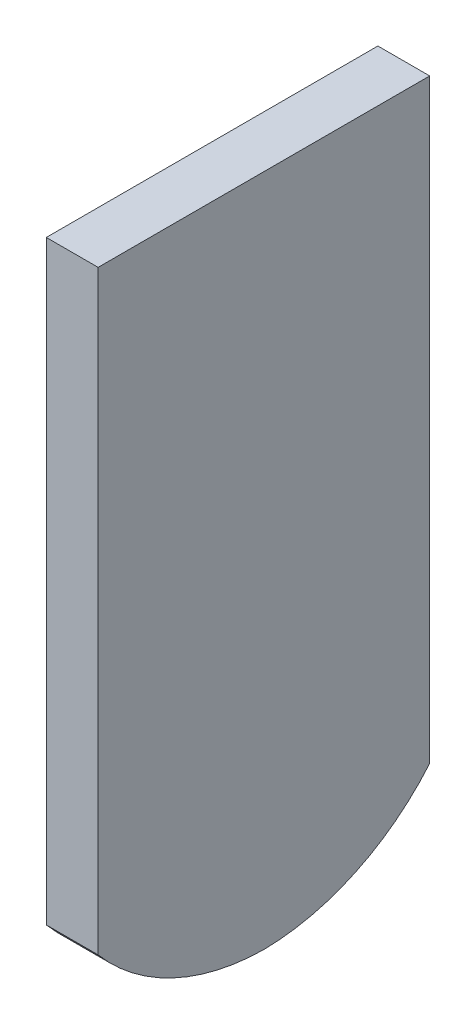
ISO-10303-21;
HEADER;
FILE_DESCRIPTION(('STEP AP214'),'2;1');
FILE_NAME('part.step','',(''),(''),'','','');
FILE_SCHEMA(('AUTOMOTIVE_DESIGN { 1 0 10303 214 1 1 1 1 }'));
ENDSEC;
DATA;
#1=APPLICATION_CONTEXT('core data for automotive mechanical design processes');
#2=APPLICATION_PROTOCOL_DEFINITION('international standard','automotive_design',2000,#1);
#3=PRODUCT_CONTEXT('',#1,'mechanical');
#4=PRODUCT('Part','Part','',(#3));
#5=PRODUCT_RELATED_PRODUCT_CATEGORY('part','',(#4));
#6=PRODUCT_DEFINITION_FORMATION('','',#4);
#7=PRODUCT_DEFINITION_CONTEXT('part definition',#1,'design');
#8=PRODUCT_DEFINITION('design','',#6,#7);
#9=PRODUCT_DEFINITION_SHAPE('','',#8);
#10=(LENGTH_UNIT() NAMED_UNIT(*) SI_UNIT(.MILLI.,.METRE.));
#11=(NAMED_UNIT(*) PLANE_ANGLE_UNIT() SI_UNIT($,.RADIAN.));
#12=(NAMED_UNIT(*) SI_UNIT($,.STERADIAN.) SOLID_ANGLE_UNIT());
#13=UNCERTAINTY_MEASURE_WITH_UNIT(LENGTH_MEASURE(1.E-05),#10,'distance_accuracy_value','');
#14=(GEOMETRIC_REPRESENTATION_CONTEXT(3) GLOBAL_UNCERTAINTY_ASSIGNED_CONTEXT((#13)) GLOBAL_UNIT_ASSIGNED_CONTEXT((#10,
#11,#12)) REPRESENTATION_CONTEXT('',''));
#15=CARTESIAN_POINT('',(0.,0.,0.));
#16=DIRECTION('',(0.,0.,1.));
#17=DIRECTION('',(1.,0.,0.));
#18=AXIS2_PLACEMENT_3D('',#15,#16,#17);
#19=CARTESIAN_POINT('',(47.975000062,56.813409305375,30.475));
#20=DIRECTION('',(-1.,0.,0.));
#21=DIRECTION('',(0.,0.,1.));
#22=AXIS2_PLACEMENT_3D('',#19,#20,#21);
#23=PLANE('',#22);
#24=DIRECTION('',(0.,-1.,0.));
#25=VECTOR('',#24,1.);
#26=CARTESIAN_POINT('',(47.975000062,149.7,-30.475));
#27=LINE('',#26,#25);
#28=CARTESIAN_POINT('',(47.975000062,140.175,-30.475));
#29=VERTEX_POINT('',#28);
#30=CARTESIAN_POINT('',(47.975000062,30.7285789436494,-30.475));
#31=VERTEX_POINT('',#30);
#32=EDGE_CURVE('E93',#29,#31,#27,.T.);
#33=ORIENTED_EDGE('',*,*,#32,.T.);
#34=CARTESIAN_POINT('',(47.975000062,56.813409305375,0.479999999999994));
#35=DIRECTION('',(-1.,0.,0.));
#36=DIRECTION('',(0.,0.,1.));
#37=AXIS2_PLACEMENT_3D('',#34,#35,#36);
#38=CIRCLE('',#37,40.48);
#39=CARTESIAN_POINT('',(47.975000062,16.3362552552198,-2.99402429931872E-13));
#40=VERTEX_POINT('',#39);
#41=EDGE_CURVE('E95',#40,#31,#38,.F.);
#42=ORIENTED_EDGE('',*,*,#41,.F.);
#43=CARTESIAN_POINT('',(47.975000062,56.813409305375,-0.480000000000008));
#44=DIRECTION('',(-1.,0.,0.));
#45=DIRECTION('',(0.,0.,1.));
#46=AXIS2_PLACEMENT_3D('',#43,#44,#45);
#47=CIRCLE('',#46,40.48);
#48=CARTESIAN_POINT('',(47.975000062,30.7285789436494,30.475));
#49=VERTEX_POINT('',#48);
#50=EDGE_CURVE('E49',#49,#40,#47,.F.);
#51=ORIENTED_EDGE('',*,*,#50,.F.);
#52=DIRECTION('',(0.,-1.,0.));
#53=VECTOR('',#52,1.);
#54=CARTESIAN_POINT('',(47.975000062,149.7,30.475));
#55=LINE('',#54,#53);
#56=CARTESIAN_POINT('',(47.975000062,140.175,30.475));
#57=VERTEX_POINT('',#56);
#58=EDGE_CURVE('E11',#57,#49,#55,.T.);
#59=ORIENTED_EDGE('',*,*,#58,.F.);
#60=DIRECTION('',(0.,0.,-1.));
#61=VECTOR('',#60,1.);
#62=CARTESIAN_POINT('',(47.975000062,140.175,0.));
#63=LINE('',#62,#61);
#64=EDGE_CURVE('E97',#57,#29,#63,.T.);
#65=ORIENTED_EDGE('',*,*,#64,.T.);
#66=EDGE_LOOP('',(#33,#42,#51,#59,#65));
#67=FACE_BOUND('',#66,.T.);
#68=ADVANCED_FACE('F45',(#67),#23,.T.);
#69=CARTESIAN_POINT('',(-47.975000062,140.175,30.475));
#70=DIRECTION('',(0.,0.,-1.));
#71=DIRECTION('',(-1.,0.,0.));
#72=AXIS2_PLACEMENT_3D('',#69,#70,#71);
#73=PLANE('',#72);
#74=ORIENTED_EDGE('',*,*,#58,.T.);
#75=DIRECTION('',(-1.,0.,0.));
#76=VECTOR('',#75,1.);
#77=CARTESIAN_POINT('',(-57.500000062,30.7285789436494,30.475));
#78=LINE('',#77,#76);
#79=CARTESIAN_POINT('',(57.500000062,30.7285789436494,30.475));
#80=VERTEX_POINT('',#79);
#81=EDGE_CURVE('E111',#49,#80,#78,.F.);
#82=ORIENTED_EDGE('',*,*,#81,.T.);
#83=DIRECTION('',(0.,1.,0.));
#84=VECTOR('',#83,1.);
#85=CARTESIAN_POINT('',(57.500000062,56.813409305375,30.475));
#86=LINE('',#85,#84);
#87=CARTESIAN_POINT('',(57.500000062,140.175,30.475));
#88=VERTEX_POINT('',#87);
#89=EDGE_CURVE('E54',#80,#88,#86,.T.);
#90=ORIENTED_EDGE('',*,*,#89,.T.);
#91=DIRECTION('',(1.,0.,0.));
#92=VECTOR('',#91,1.);
#93=CARTESIAN_POINT('',(47.975000062,140.175,30.475));
#94=LINE('',#93,#92);
#95=EDGE_CURVE('E67',#57,#88,#94,.T.);
#96=ORIENTED_EDGE('',*,*,#95,.F.);
#97=EDGE_LOOP('',(#74,#82,#90,#96));
#98=FACE_BOUND('',#97,.T.);
#99=ADVANCED_FACE('F124',(#98),#73,.F.);
#100=CARTESIAN_POINT('',(47.975000062,140.175,-30.475));
#101=DIRECTION('',(0.,0.,1.));
#102=DIRECTION('',(1.,0.,0.));
#103=AXIS2_PLACEMENT_3D('',#100,#101,#102);
#104=PLANE('',#103);
#105=DIRECTION('',(-1.,0.,0.));
#106=VECTOR('',#105,1.);
#107=CARTESIAN_POINT('',(-57.500000062,30.7285789436494,-30.475));
#108=LINE('',#107,#106);
#109=CARTESIAN_POINT('',(57.500000062,30.7285789436495,-30.475));
#110=VERTEX_POINT('',#109);
#111=EDGE_CURVE('E105',#110,#31,#108,.T.);
#112=ORIENTED_EDGE('',*,*,#111,.T.);
#113=ORIENTED_EDGE('',*,*,#32,.F.);
#114=DIRECTION('',(-1.,0.,0.));
#115=VECTOR('',#114,1.);
#116=CARTESIAN_POINT('',(47.975000062,140.175,-30.475));
#117=LINE('',#116,#115);
#118=CARTESIAN_POINT('',(57.500000062,140.175,-30.475));
#119=VERTEX_POINT('',#118);
#120=EDGE_CURVE('E112',#119,#29,#117,.T.);
#121=ORIENTED_EDGE('',*,*,#120,.F.);
#122=DIRECTION('',(0.,-1.,0.));
#123=VECTOR('',#122,1.);
#124=CARTESIAN_POINT('',(57.500000062,56.813409305375,-30.475));
#125=LINE('',#124,#123);
#126=EDGE_CURVE('E109',#119,#110,#125,.T.);
#127=ORIENTED_EDGE('',*,*,#126,.T.);
#128=EDGE_LOOP('',(#112,#113,#121,#127));
#129=FACE_BOUND('',#128,.T.);
#130=ADVANCED_FACE('F107',(#129),#104,.F.);
#131=CARTESIAN_POINT('',(-57.500000062,56.813409305375,0.479999999999994));
#132=DIRECTION('',(-1.,0.,0.));
#133=DIRECTION('',(0.,0.,1.));
#134=AXIS2_PLACEMENT_3D('',#131,#132,#133);
#135=CYLINDRICAL_SURFACE('',#134,40.48);
#136=DIRECTION('',(-1.,0.,0.));
#137=VECTOR('',#136,1.);
#138=CARTESIAN_POINT('',(0.,16.3362552552198,-2.99402429931872E-13));
#139=LINE('',#138,#137);
#140=CARTESIAN_POINT('',(57.500000062,16.3362552552198,-2.99510850149121E-13));
#141=VERTEX_POINT('',#140);
#142=EDGE_CURVE('E100',#40,#141,#139,.F.);
#143=ORIENTED_EDGE('',*,*,#142,.F.);
#144=ORIENTED_EDGE('',*,*,#41,.T.);
#145=ORIENTED_EDGE('',*,*,#111,.F.);
#146=CARTESIAN_POINT('',(57.500000062,56.813409305375,0.479999999999994));
#147=DIRECTION('',(-1.,0.,0.));
#148=DIRECTION('',(0.,0.,1.));
#149=AXIS2_PLACEMENT_3D('',#146,#147,#148);
#150=CIRCLE('',#149,40.48);
#151=EDGE_CURVE('E133',#141,#110,#150,.F.);
#152=ORIENTED_EDGE('',*,*,#151,.F.);
#153=EDGE_LOOP('',(#143,#144,#145,#152));
#154=FACE_BOUND('',#153,.T.);
#155=ADVANCED_FACE('F103',(#154),#135,.T.);
#156=CARTESIAN_POINT('',(-57.500000062,56.813409305375,-0.480000000000008));
#157=DIRECTION('',(-1.,0.,0.));
#158=DIRECTION('',(0.,0.,1.));
#159=AXIS2_PLACEMENT_3D('',#156,#157,#158);
#160=CYLINDRICAL_SURFACE('',#159,40.48);
#161=ORIENTED_EDGE('',*,*,#81,.F.);
#162=ORIENTED_EDGE('',*,*,#50,.T.);
#163=ORIENTED_EDGE('',*,*,#142,.T.);
#164=CARTESIAN_POINT('',(57.500000062,56.813409305375,-0.480000000000008));
#165=DIRECTION('',(-1.,0.,0.));
#166=DIRECTION('',(0.,0.,1.));
#167=AXIS2_PLACEMENT_3D('',#164,#165,#166);
#168=CIRCLE('',#167,40.48);
#169=EDGE_CURVE('E121',#80,#141,#168,.F.);
#170=ORIENTED_EDGE('',*,*,#169,.F.);
#171=EDGE_LOOP('',(#161,#162,#163,#170));
#172=FACE_BOUND('',#171,.T.);
#173=ADVANCED_FACE('F47',(#172),#160,.T.);
#174=CARTESIAN_POINT('',(47.975000062,140.175,30.475));
#175=DIRECTION('',(0.,-1.,0.));
#176=DIRECTION('',(0.,0.,-1.));
#177=AXIS2_PLACEMENT_3D('',#174,#175,#176);
#178=PLANE('',#177);
#179=DIRECTION('',(0.,0.,-1.));
#180=VECTOR('',#179,1.);
#181=CARTESIAN_POINT('',(57.500000062,140.175,40.));
#182=LINE('',#181,#180);
#183=EDGE_CURVE('E128',#88,#119,#182,.T.);
#184=ORIENTED_EDGE('',*,*,#183,.T.);
#185=ORIENTED_EDGE('',*,*,#120,.T.);
#186=ORIENTED_EDGE('',*,*,#64,.F.);
#187=ORIENTED_EDGE('',*,*,#95,.T.);
#188=EDGE_LOOP('',(#184,#185,#186,#187));
#189=FACE_BOUND('',#188,.T.);
#190=ADVANCED_FACE('F137',(#189),#178,.F.);
#191=CARTESIAN_POINT('',(57.500000062,56.813409305375,40.));
#192=DIRECTION('',(1.,0.,0.));
#193=DIRECTION('',(0.,0.,-1.));
#194=AXIS2_PLACEMENT_3D('',#191,#192,#193);
#195=PLANE('',#194);
#196=ORIENTED_EDGE('',*,*,#126,.F.);
#197=ORIENTED_EDGE('',*,*,#183,.F.);
#198=ORIENTED_EDGE('',*,*,#89,.F.);
#199=ORIENTED_EDGE('',*,*,#169,.T.);
#200=ORIENTED_EDGE('',*,*,#151,.T.);
#201=EDGE_LOOP('',(#196,#197,#198,#199,#200));
#202=FACE_BOUND('',#201,.T.);
#203=ADVANCED_FACE('F127',(#202),#195,.T.);
#204=CLOSED_SHELL('',(#68,#99,#130,#155,#173,#190,#203));
#205=MANIFOLD_SOLID_BREP('B2',#204);
#206=ADVANCED_BREP_SHAPE_REPRESENTATION('',(#18,#205),#14);
#207=SHAPE_DEFINITION_REPRESENTATION(#9,#206);
ENDSEC;
END-ISO-10303-21;
